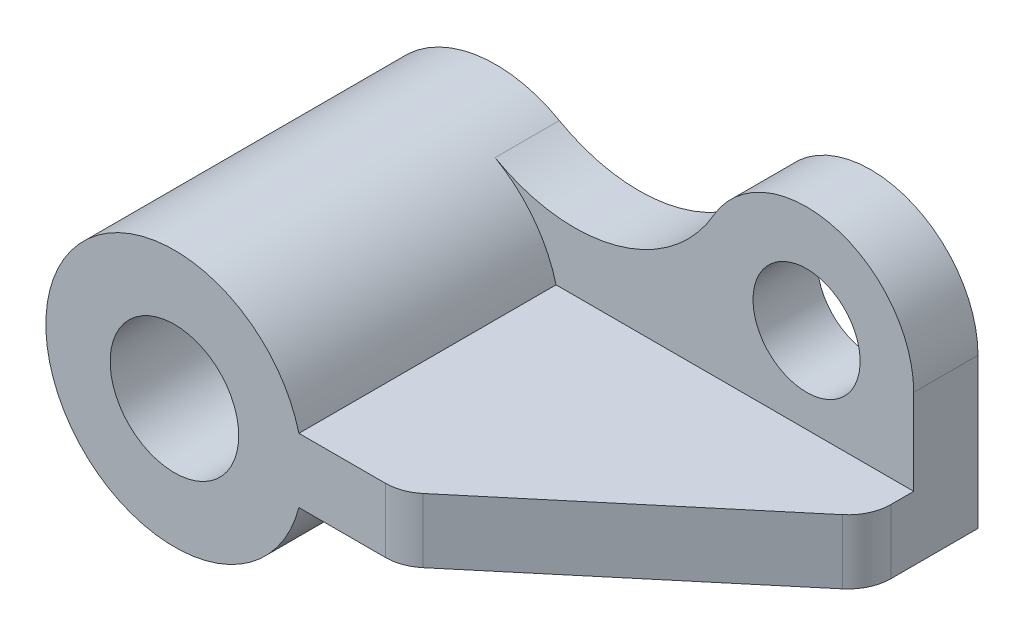
ISO-10303-21;
HEADER;
FILE_DESCRIPTION(('STEP AP214'),'2;1');
FILE_NAME('part.step','',(''),(''),'','','');
FILE_SCHEMA(('AUTOMOTIVE_DESIGN { 1 0 10303 214 1 1 1 1 }'));
ENDSEC;
DATA;
#1=APPLICATION_CONTEXT('core data for automotive mechanical design processes');
#2=APPLICATION_PROTOCOL_DEFINITION('international standard','automotive_design',2000,#1);
#3=PRODUCT_CONTEXT('',#1,'mechanical');
#4=PRODUCT('Part','Part','',(#3));
#5=PRODUCT_RELATED_PRODUCT_CATEGORY('part','',(#4));
#6=PRODUCT_DEFINITION_FORMATION('','',#4);
#7=PRODUCT_DEFINITION_CONTEXT('part definition',#1,'design');
#8=PRODUCT_DEFINITION('design','',#6,#7);
#9=PRODUCT_DEFINITION_SHAPE('','',#8);
#10=(LENGTH_UNIT() NAMED_UNIT(*) SI_UNIT(.MILLI.,.METRE.));
#11=(NAMED_UNIT(*) PLANE_ANGLE_UNIT() SI_UNIT($,.RADIAN.));
#12=(NAMED_UNIT(*) SI_UNIT($,.STERADIAN.) SOLID_ANGLE_UNIT());
#13=UNCERTAINTY_MEASURE_WITH_UNIT(LENGTH_MEASURE(1.E-05),#10,'distance_accuracy_value','');
#14=(GEOMETRIC_REPRESENTATION_CONTEXT(3) GLOBAL_UNCERTAINTY_ASSIGNED_CONTEXT((#13)) GLOBAL_UNIT_ASSIGNED_CONTEXT((#10,
#11,#12)) REPRESENTATION_CONTEXT('',''));
#15=CARTESIAN_POINT('',(0.,0.,0.));
#16=DIRECTION('',(0.,0.,1.));
#17=DIRECTION('',(1.,0.,0.));
#18=AXIS2_PLACEMENT_3D('',#15,#16,#17);
#19=CARTESIAN_POINT('',(58.0947501931113,15.,75.));
#20=DIRECTION('',(0.,-1.,0.));
#21=DIRECTION('',(0.,0.,-1.));
#22=AXIS2_PLACEMENT_3D('',#19,#20,#21);
#23=PLANE('',#22);
#24=DIRECTION('',(-0.766044443118975,0.,0.642787609686543));
#25=VECTOR('',#24,1.);
#26=CARTESIAN_POINT('',(225.,15.,-25.));
#27=LINE('',#26,#25);
#28=CARTESIAN_POINT('',(217.855752193731,15.,-19.0052643007204));
#29=VERTEX_POINT('',#28);
#30=CARTESIAN_POINT('',(111.400988248987,15.,70.3208888623795));
#31=VERTEX_POINT('',#30);
#32=EDGE_CURVE('E196',#29,#31,#27,.T.);
#33=ORIENTED_EDGE('',*,*,#32,.F.);
#34=CARTESIAN_POINT('',(205.,15.,-34.3261531630999));
#35=DIRECTION('',(0.,-1.,0.));
#36=DIRECTION('',(0.,0.,-1.));
#37=AXIS2_PLACEMENT_3D('',#34,#35,#36);
#38=CIRCLE('',#37,20.);
#39=CARTESIAN_POINT('',(225.,15.,-34.3261531630999));
#40=VERTEX_POINT('',#39);
#41=EDGE_CURVE('E44',#29,#40,#38,.F.);
#42=ORIENTED_EDGE('',*,*,#41,.T.);
#43=DIRECTION('',(0.,0.,-1.));
#44=VECTOR('',#43,1.);
#45=CARTESIAN_POINT('',(225.,15.,75.));
#46=LINE('',#45,#44);
#47=CARTESIAN_POINT('',(225.,15.,-45.));
#48=VERTEX_POINT('',#47);
#49=EDGE_CURVE('E176',#40,#48,#46,.T.);
#50=ORIENTED_EDGE('',*,*,#49,.T.);
#51=DIRECTION('',(-1.,0.,0.));
#52=VECTOR('',#51,1.);
#53=CARTESIAN_POINT('',(225.,15.,-45.));
#54=LINE('',#53,#52);
#55=CARTESIAN_POINT('',(58.0947501931113,15.,-45.));
#56=VERTEX_POINT('',#55);
#57=EDGE_CURVE('E141',#48,#56,#54,.T.);
#58=ORIENTED_EDGE('',*,*,#57,.T.);
#59=DIRECTION('',(0.,0.,-1.));
#60=VECTOR('',#59,1.);
#61=CARTESIAN_POINT('',(58.0947501931113,15.,75.));
#62=LINE('',#61,#60);
#63=CARTESIAN_POINT('',(58.0947501931113,15.,75.));
#64=VERTEX_POINT('',#63);
#65=EDGE_CURVE('E168',#64,#56,#62,.T.);
#66=ORIENTED_EDGE('',*,*,#65,.F.);
#67=DIRECTION('',(-1.,0.,0.));
#68=VECTOR('',#67,1.);
#69=CARTESIAN_POINT('',(58.0947501931113,15.,75.));
#70=LINE('',#69,#68);
#71=CARTESIAN_POINT('',(98.5452360552561,15.,75.));
#72=VERTEX_POINT('',#71);
#73=EDGE_CURVE('E166',#72,#64,#70,.T.);
#74=ORIENTED_EDGE('',*,*,#73,.F.);
#75=CARTESIAN_POINT('',(98.5452360552561,15.,55.));
#76=DIRECTION('',(0.,-1.,0.));
#77=DIRECTION('',(0.,0.,-1.));
#78=AXIS2_PLACEMENT_3D('',#75,#76,#77);
#79=CIRCLE('',#78,20.);
#80=EDGE_CURVE('E51',#72,#31,#79,.F.);
#81=ORIENTED_EDGE('',*,*,#80,.T.);
#82=EDGE_LOOP('',(#33,#42,#50,#58,#66,#74,#81));
#83=FACE_BOUND('',#82,.T.);
#84=ADVANCED_FACE('F36',(#83),#23,.F.);
#85=CARTESIAN_POINT('',(0.,0.,75.));
#86=DIRECTION('',(0.,0.,1.));
#87=DIRECTION('',(1.,0.,0.));
#88=AXIS2_PLACEMENT_3D('',#85,#86,#87);
#89=PLANE('',#88);
#90=DIRECTION('',(1.,0.,0.));
#91=VECTOR('',#90,1.);
#92=CARTESIAN_POINT('',(58.0947501931113,-15.,75.));
#93=LINE('',#92,#91);
#94=CARTESIAN_POINT('',(58.0947501931113,-15.,75.));
#95=VERTEX_POINT('',#94);
#96=CARTESIAN_POINT('',(98.5452360552561,-15.,75.));
#97=VERTEX_POINT('',#96);
#98=EDGE_CURVE('E162',#95,#97,#93,.T.);
#99=ORIENTED_EDGE('',*,*,#98,.T.);
#100=DIRECTION('',(0.,1.,0.));
#101=VECTOR('',#100,1.);
#102=CARTESIAN_POINT('',(98.5452360552561,15.,75.));
#103=LINE('',#102,#101);
#104=EDGE_CURVE('E11',#97,#72,#103,.T.);
#105=ORIENTED_EDGE('',*,*,#104,.T.);
#106=ORIENTED_EDGE('',*,*,#73,.T.);
#107=CARTESIAN_POINT('',(0.,0.,75.));
#108=DIRECTION('',(0.,0.,1.));
#109=DIRECTION('',(1.,0.,0.));
#110=AXIS2_PLACEMENT_3D('',#107,#108,#109);
#111=CIRCLE('',#110,60.);
#112=EDGE_CURVE('E159',#64,#95,#111,.T.);
#113=ORIENTED_EDGE('',*,*,#112,.T.);
#114=EDGE_LOOP('',(#99,#105,#106,#113));
#115=FACE_BOUND('',#114,.T.);
#116=CARTESIAN_POINT('',(0.,0.,75.));
#117=DIRECTION('',(0.,0.,1.));
#118=DIRECTION('',(1.,0.,0.));
#119=AXIS2_PLACEMENT_3D('',#116,#117,#118);
#120=CIRCLE('',#119,30.);
#121=CARTESIAN_POINT('',(30.,0.,75.));
#122=VERTEX_POINT('',#121);
#123=EDGE_CURVE('E153',#122,#122,#120,.T.);
#124=ORIENTED_EDGE('',*,*,#123,.F.);
#125=EDGE_LOOP('',(#124));
#126=FACE_BOUND('',#125,.T.);
#127=ADVANCED_FACE('F225',(#115,#126),#89,.T.);
#128=CARTESIAN_POINT('',(0.,0.,-75.));
#129=DIRECTION('',(0.,0.,1.));
#130=DIRECTION('',(1.,0.,0.));
#131=AXIS2_PLACEMENT_3D('',#128,#129,#130);
#132=PLANE('',#131);
#133=CARTESIAN_POINT('',(0.,0.,-75.));
#134=DIRECTION('',(0.,0.,1.));
#135=DIRECTION('',(1.,0.,0.));
#136=AXIS2_PLACEMENT_3D('',#133,#134,#135);
#137=CIRCLE('',#136,60.);
#138=CARTESIAN_POINT('',(29.635348145146,52.1703569119092,-75.));
#139=VERTEX_POINT('',#138);
#140=CARTESIAN_POINT('',(58.0947501931113,-15.,-75.));
#141=VERTEX_POINT('',#140);
#142=EDGE_CURVE('E156',#139,#141,#137,.T.);
#143=ORIENTED_EDGE('',*,*,#142,.F.);
#144=CARTESIAN_POINT('',(66.6795333265785,117.383303051796,-75.));
#145=DIRECTION('',(0.,0.,1.));
#146=DIRECTION('',(-1.,0.,0.));
#147=AXIS2_PLACEMENT_3D('',#144,#145,#146);
#148=CIRCLE('',#147,75.);
#149=CARTESIAN_POINT('',(131.671813330631,79.9533212207183,-75.));
#150=VERTEX_POINT('',#149);
#151=EDGE_CURVE('E146',#139,#150,#148,.T.);
#152=ORIENTED_EDGE('',*,*,#151,.T.);
#153=CARTESIAN_POINT('',(175.,55.,-75.));
#154=DIRECTION('',(0.,0.,-1.));
#155=DIRECTION('',(1.,0.,0.));
#156=AXIS2_PLACEMENT_3D('',#153,#154,#155);
#157=CIRCLE('',#156,50.);
#158=CARTESIAN_POINT('',(225.,55.,-75.));
#159=VERTEX_POINT('',#158);
#160=EDGE_CURVE('E120',#150,#159,#157,.T.);
#161=ORIENTED_EDGE('',*,*,#160,.T.);
#162=DIRECTION('',(0.,1.,0.));
#163=VECTOR('',#162,1.);
#164=CARTESIAN_POINT('',(225.,15.,-75.));
#165=LINE('',#164,#163);
#166=CARTESIAN_POINT('',(225.,-15.,-75.));
#167=VERTEX_POINT('',#166);
#168=EDGE_CURVE('E163',#167,#159,#165,.T.);
#169=ORIENTED_EDGE('',*,*,#168,.F.);
#170=DIRECTION('',(1.,0.,0.));
#171=VECTOR('',#170,1.);
#172=CARTESIAN_POINT('',(58.0947501931113,-15.,-75.));
#173=LINE('',#172,#171);
#174=EDGE_CURVE('E170',#141,#167,#173,.T.);
#175=ORIENTED_EDGE('',*,*,#174,.F.);
#176=EDGE_LOOP('',(#143,#152,#161,#169,#175));
#177=FACE_BOUND('',#176,.T.);
#178=CARTESIAN_POINT('',(0.,0.,-75.));
#179=DIRECTION('',(0.,0.,1.));
#180=DIRECTION('',(1.,0.,0.));
#181=AXIS2_PLACEMENT_3D('',#178,#179,#180);
#182=CIRCLE('',#181,30.);
#183=CARTESIAN_POINT('',(30.,0.,-75.));
#184=VERTEX_POINT('',#183);
#185=EDGE_CURVE('E150',#184,#184,#182,.T.);
#186=ORIENTED_EDGE('',*,*,#185,.T.);
#187=EDGE_LOOP('',(#186));
#188=FACE_BOUND('',#187,.T.);
#189=CARTESIAN_POINT('',(175.,55.,-75.));
#190=DIRECTION('',(0.,0.,-1.));
#191=DIRECTION('',(-1.,0.,0.));
#192=AXIS2_PLACEMENT_3D('',#189,#190,#191);
#193=CIRCLE('',#192,25.);
#194=CARTESIAN_POINT('',(150.,55.,-75.));
#195=VERTEX_POINT('',#194);
#196=EDGE_CURVE('E212',#195,#195,#193,.T.);
#197=ORIENTED_EDGE('',*,*,#196,.F.);
#198=EDGE_LOOP('',(#197));
#199=FACE_BOUND('',#198,.T.);
#200=ADVANCED_FACE('F231',(#177,#188,#199),#132,.F.);
#201=CARTESIAN_POINT('',(0.,0.,75.));
#202=DIRECTION('',(0.,0.,-1.));
#203=DIRECTION('',(-1.,0.,0.));
#204=AXIS2_PLACEMENT_3D('',#201,#202,#203);
#205=CYLINDRICAL_SURFACE('',#204,60.);
#206=CARTESIAN_POINT('',(0.,0.,-45.));
#207=DIRECTION('',(0.,0.,1.));
#208=DIRECTION('',(-1.,0.,0.));
#209=AXIS2_PLACEMENT_3D('',#206,#207,#208);
#210=CIRCLE('',#209,60.);
#211=CARTESIAN_POINT('',(29.635348145146,52.1703569119092,-45.));
#212=VERTEX_POINT('',#211);
#213=EDGE_CURVE('E139',#56,#212,#210,.T.);
#214=ORIENTED_EDGE('',*,*,#213,.T.);
#215=DIRECTION('',(0.,0.,-1.));
#216=VECTOR('',#215,1.);
#217=CARTESIAN_POINT('',(29.635348145146,52.1703569119092,-45.));
#218=LINE('',#217,#216);
#219=EDGE_CURVE('E126',#212,#139,#218,.T.);
#220=ORIENTED_EDGE('',*,*,#219,.T.);
#221=ORIENTED_EDGE('',*,*,#142,.T.);
#222=DIRECTION('',(0.,0.,-1.));
#223=VECTOR('',#222,1.);
#224=CARTESIAN_POINT('',(58.0947501931113,-15.,75.));
#225=LINE('',#224,#223);
#226=EDGE_CURVE('E180',#95,#141,#225,.T.);
#227=ORIENTED_EDGE('',*,*,#226,.F.);
#228=ORIENTED_EDGE('',*,*,#112,.F.);
#229=ORIENTED_EDGE('',*,*,#65,.T.);
#230=EDGE_LOOP('',(#214,#220,#221,#227,#228,#229));
#231=FACE_BOUND('',#230,.T.);
#232=ADVANCED_FACE('F222',(#231),#205,.T.);
#233=CARTESIAN_POINT('',(58.0947501931113,-15.,75.));
#234=DIRECTION('',(0.,1.,0.));
#235=DIRECTION('',(0.,0.,1.));
#236=AXIS2_PLACEMENT_3D('',#233,#234,#235);
#237=PLANE('',#236);
#238=DIRECTION('',(0.,0.,-1.));
#239=VECTOR('',#238,1.);
#240=CARTESIAN_POINT('',(225.,-15.,75.));
#241=LINE('',#240,#239);
#242=CARTESIAN_POINT('',(225.,-15.,-34.3261531630999));
#243=VERTEX_POINT('',#242);
#244=EDGE_CURVE('E178',#243,#167,#241,.T.);
#245=ORIENTED_EDGE('',*,*,#244,.F.);
#246=CARTESIAN_POINT('',(205.,-15.,-34.3261531630999));
#247=DIRECTION('',(0.,1.,0.));
#248=DIRECTION('',(0.,0.,1.));
#249=AXIS2_PLACEMENT_3D('',#246,#247,#248);
#250=CIRCLE('',#249,20.);
#251=CARTESIAN_POINT('',(217.855752193731,-15.,-19.0052643007204));
#252=VERTEX_POINT('',#251);
#253=EDGE_CURVE('E188',#243,#252,#250,.F.);
#254=ORIENTED_EDGE('',*,*,#253,.T.);
#255=DIRECTION('',(-0.766044443118975,0.,0.642787609686543));
#256=VECTOR('',#255,1.);
#257=CARTESIAN_POINT('',(77.8155912099409,-15.,98.5023831307858));
#258=LINE('',#257,#256);
#259=CARTESIAN_POINT('',(111.400988248987,-15.,70.3208888623795));
#260=VERTEX_POINT('',#259);
#261=EDGE_CURVE('E208',#252,#260,#258,.T.);
#262=ORIENTED_EDGE('',*,*,#261,.T.);
#263=CARTESIAN_POINT('',(98.5452360552561,-15.,55.));
#264=DIRECTION('',(0.,1.,0.));
#265=DIRECTION('',(0.,0.,1.));
#266=AXIS2_PLACEMENT_3D('',#263,#264,#265);
#267=CIRCLE('',#266,20.);
#268=EDGE_CURVE('E186',#260,#97,#267,.F.);
#269=ORIENTED_EDGE('',*,*,#268,.T.);
#270=ORIENTED_EDGE('',*,*,#98,.F.);
#271=ORIENTED_EDGE('',*,*,#226,.T.);
#272=ORIENTED_EDGE('',*,*,#174,.T.);
#273=EDGE_LOOP('',(#245,#254,#262,#269,#270,#271,#272));
#274=FACE_BOUND('',#273,.T.);
#275=ADVANCED_FACE('F207',(#274),#237,.F.);
#276=CARTESIAN_POINT('',(225.,15.,75.));
#277=DIRECTION('',(-1.,0.,0.));
#278=DIRECTION('',(0.,0.,1.));
#279=AXIS2_PLACEMENT_3D('',#276,#277,#278);
#280=PLANE('',#279);
#281=ORIENTED_EDGE('',*,*,#49,.F.);
#282=DIRECTION('',(0.,-1.,0.));
#283=VECTOR('',#282,1.);
#284=CARTESIAN_POINT('',(225.,15.,-34.3261531630999));
#285=LINE('',#284,#283);
#286=EDGE_CURVE('E183',#40,#243,#285,.T.);
#287=ORIENTED_EDGE('',*,*,#286,.T.);
#288=ORIENTED_EDGE('',*,*,#244,.T.);
#289=ORIENTED_EDGE('',*,*,#168,.T.);
#290=DIRECTION('',(0.,0.,-1.));
#291=VECTOR('',#290,1.);
#292=CARTESIAN_POINT('',(225.,55.,-45.));
#293=LINE('',#292,#291);
#294=CARTESIAN_POINT('',(225.,55.,-45.));
#295=VERTEX_POINT('',#294);
#296=EDGE_CURVE('E125',#295,#159,#293,.T.);
#297=ORIENTED_EDGE('',*,*,#296,.F.);
#298=DIRECTION('',(0.,-1.,0.));
#299=VECTOR('',#298,1.);
#300=CARTESIAN_POINT('',(225.,15.,-45.));
#301=LINE('',#300,#299);
#302=EDGE_CURVE('E135',#295,#48,#301,.T.);
#303=ORIENTED_EDGE('',*,*,#302,.T.);
#304=EDGE_LOOP('',(#281,#287,#288,#289,#297,#303));
#305=FACE_BOUND('',#304,.T.);
#306=ADVANCED_FACE('F201',(#305),#280,.F.);
#307=CARTESIAN_POINT('',(0.,0.,75.));
#308=DIRECTION('',(0.,0.,-1.));
#309=DIRECTION('',(-1.,0.,0.));
#310=AXIS2_PLACEMENT_3D('',#307,#308,#309);
#311=CYLINDRICAL_SURFACE('',#310,30.);
#312=ORIENTED_EDGE('',*,*,#123,.T.);
#313=EDGE_LOOP('',(#312));
#314=FACE_BOUND('',#313,.T.);
#315=ORIENTED_EDGE('',*,*,#185,.F.);
#316=EDGE_LOOP('',(#315));
#317=FACE_BOUND('',#316,.T.);
#318=ADVANCED_FACE('F260',(#314,#317),#311,.F.);
#319=CARTESIAN_POINT('',(175.,55.,-45.));
#320=DIRECTION('',(0.,0.,-1.));
#321=DIRECTION('',(-1.,0.,0.));
#322=AXIS2_PLACEMENT_3D('',#319,#320,#321);
#323=CYLINDRICAL_SURFACE('',#322,50.);
#324=ORIENTED_EDGE('',*,*,#160,.F.);
#325=DIRECTION('',(0.,0.,-1.));
#326=VECTOR('',#325,1.);
#327=CARTESIAN_POINT('',(131.671813330631,79.9533212207183,-45.));
#328=LINE('',#327,#326);
#329=CARTESIAN_POINT('',(131.671813330631,79.9533212207183,-45.));
#330=VERTEX_POINT('',#329);
#331=EDGE_CURVE('E113',#330,#150,#328,.T.);
#332=ORIENTED_EDGE('',*,*,#331,.F.);
#333=CARTESIAN_POINT('',(175.,55.,-45.));
#334=DIRECTION('',(0.,0.,-1.));
#335=DIRECTION('',(1.,0.,0.));
#336=AXIS2_PLACEMENT_3D('',#333,#334,#335);
#337=CIRCLE('',#336,50.);
#338=EDGE_CURVE('E117',#330,#295,#337,.T.);
#339=ORIENTED_EDGE('',*,*,#338,.T.);
#340=ORIENTED_EDGE('',*,*,#296,.T.);
#341=EDGE_LOOP('',(#324,#332,#339,#340));
#342=FACE_BOUND('',#341,.T.);
#343=ADVANCED_FACE('F115',(#342),#323,.T.);
#344=CARTESIAN_POINT('',(66.6795333265785,117.383303051796,-45.));
#345=DIRECTION('',(0.,0.,-1.));
#346=DIRECTION('',(-1.,0.,0.));
#347=AXIS2_PLACEMENT_3D('',#344,#345,#346);
#348=CYLINDRICAL_SURFACE('',#347,75.);
#349=ORIENTED_EDGE('',*,*,#151,.F.);
#350=ORIENTED_EDGE('',*,*,#219,.F.);
#351=CARTESIAN_POINT('',(66.6795333265785,117.383303051796,-45.));
#352=DIRECTION('',(0.,0.,1.));
#353=DIRECTION('',(-1.,0.,0.));
#354=AXIS2_PLACEMENT_3D('',#351,#352,#353);
#355=CIRCLE('',#354,75.);
#356=EDGE_CURVE('E133',#212,#330,#355,.T.);
#357=ORIENTED_EDGE('',*,*,#356,.T.);
#358=ORIENTED_EDGE('',*,*,#331,.T.);
#359=EDGE_LOOP('',(#349,#350,#357,#358));
#360=FACE_BOUND('',#359,.T.);
#361=ADVANCED_FACE('F138',(#360),#348,.F.);
#362=CARTESIAN_POINT('',(0.,0.,-45.));
#363=DIRECTION('',(0.,0.,-1.));
#364=DIRECTION('',(-1.,0.,0.));
#365=AXIS2_PLACEMENT_3D('',#362,#363,#364);
#366=PLANE('',#365);
#367=CARTESIAN_POINT('',(175.,55.,-45.));
#368=DIRECTION('',(0.,0.,-1.));
#369=DIRECTION('',(-1.,0.,0.));
#370=AXIS2_PLACEMENT_3D('',#367,#368,#369);
#371=CIRCLE('',#370,25.);
#372=CARTESIAN_POINT('',(150.,55.,-45.));
#373=VERTEX_POINT('',#372);
#374=EDGE_CURVE('E148',#373,#373,#371,.T.);
#375=ORIENTED_EDGE('',*,*,#374,.T.);
#376=EDGE_LOOP('',(#375));
#377=FACE_BOUND('',#376,.T.);
#378=ORIENTED_EDGE('',*,*,#57,.F.);
#379=ORIENTED_EDGE('',*,*,#302,.F.);
#380=ORIENTED_EDGE('',*,*,#338,.F.);
#381=ORIENTED_EDGE('',*,*,#356,.F.);
#382=ORIENTED_EDGE('',*,*,#213,.F.);
#383=EDGE_LOOP('',(#378,#379,#380,#381,#382));
#384=FACE_BOUND('',#383,.T.);
#385=ADVANCED_FACE('F131',(#377,#384),#366,.F.);
#386=CARTESIAN_POINT('',(175.,55.,-45.));
#387=DIRECTION('',(0.,0.,-1.));
#388=DIRECTION('',(-1.,0.,0.));
#389=AXIS2_PLACEMENT_3D('',#386,#387,#388);
#390=CYLINDRICAL_SURFACE('',#389,25.);
#391=ORIENTED_EDGE('',*,*,#374,.F.);
#392=EDGE_LOOP('',(#391));
#393=FACE_BOUND('',#392,.T.);
#394=ORIENTED_EDGE('',*,*,#196,.T.);
#395=EDGE_LOOP('',(#394));
#396=FACE_BOUND('',#395,.T.);
#397=ADVANCED_FACE('F239',(#393,#396),#390,.F.);
#398=CARTESIAN_POINT('',(225.,-60.,-25.));
#399=DIRECTION('',(-0.642787609686543,0.,-0.766044443118975));
#400=DIRECTION('',(-0.766044443118975,0.,0.642787609686543));
#401=AXIS2_PLACEMENT_3D('',#398,#399,#400);
#402=PLANE('',#401);
#403=ORIENTED_EDGE('',*,*,#261,.F.);
#404=DIRECTION('',(0.,-1.,0.));
#405=VECTOR('',#404,1.);
#406=CARTESIAN_POINT('',(217.855752193731,-60.,-19.0052643007204));
#407=LINE('',#406,#405);
#408=EDGE_CURVE('E192',#252,#29,#407,.F.);
#409=ORIENTED_EDGE('',*,*,#408,.T.);
#410=ORIENTED_EDGE('',*,*,#32,.T.);
#411=DIRECTION('',(0.,1.,0.));
#412=VECTOR('',#411,1.);
#413=CARTESIAN_POINT('',(111.400988248987,-15.,70.3208888623795));
#414=LINE('',#413,#412);
#415=EDGE_CURVE('E190',#31,#260,#414,.F.);
#416=ORIENTED_EDGE('',*,*,#415,.T.);
#417=EDGE_LOOP('',(#403,#409,#410,#416));
#418=FACE_BOUND('',#417,.T.);
#419=ADVANCED_FACE('F211',(#418),#402,.F.);
#420=CARTESIAN_POINT('',(205.,15.,-34.3261531630999));
#421=DIRECTION('',(0.,-1.,0.));
#422=DIRECTION('',(0.,0.,-1.));
#423=AXIS2_PLACEMENT_3D('',#420,#421,#422);
#424=CYLINDRICAL_SURFACE('',#423,20.);
#425=ORIENTED_EDGE('',*,*,#41,.F.);
#426=ORIENTED_EDGE('',*,*,#408,.F.);
#427=ORIENTED_EDGE('',*,*,#253,.F.);
#428=ORIENTED_EDGE('',*,*,#286,.F.);
#429=EDGE_LOOP('',(#425,#426,#427,#428));
#430=FACE_BOUND('',#429,.T.);
#431=ADVANCED_FACE('F203',(#430),#424,.T.);
#432=CARTESIAN_POINT('',(98.5452360552561,0.,55.));
#433=DIRECTION('',(0.,-1.,0.));
#434=DIRECTION('',(0.,0.,-1.));
#435=AXIS2_PLACEMENT_3D('',#432,#433,#434);
#436=CYLINDRICAL_SURFACE('',#435,20.);
#437=ORIENTED_EDGE('',*,*,#268,.F.);
#438=ORIENTED_EDGE('',*,*,#415,.F.);
#439=ORIENTED_EDGE('',*,*,#80,.F.);
#440=ORIENTED_EDGE('',*,*,#104,.F.);
#441=EDGE_LOOP('',(#437,#438,#439,#440));
#442=FACE_BOUND('',#441,.T.);
#443=ADVANCED_FACE('F38',(#442),#436,.T.);
#444=CLOSED_SHELL('',(#84,#127,#200,#232,#275,#306,#318,#343,#361,#385,#397,#419,#431,#443));
#445=MANIFOLD_SOLID_BREP('B2',#444);
#446=ADVANCED_BREP_SHAPE_REPRESENTATION('',(#18,#445),#14);
#447=SHAPE_DEFINITION_REPRESENTATION(#9,#446);
ENDSEC;
END-ISO-10303-21;
